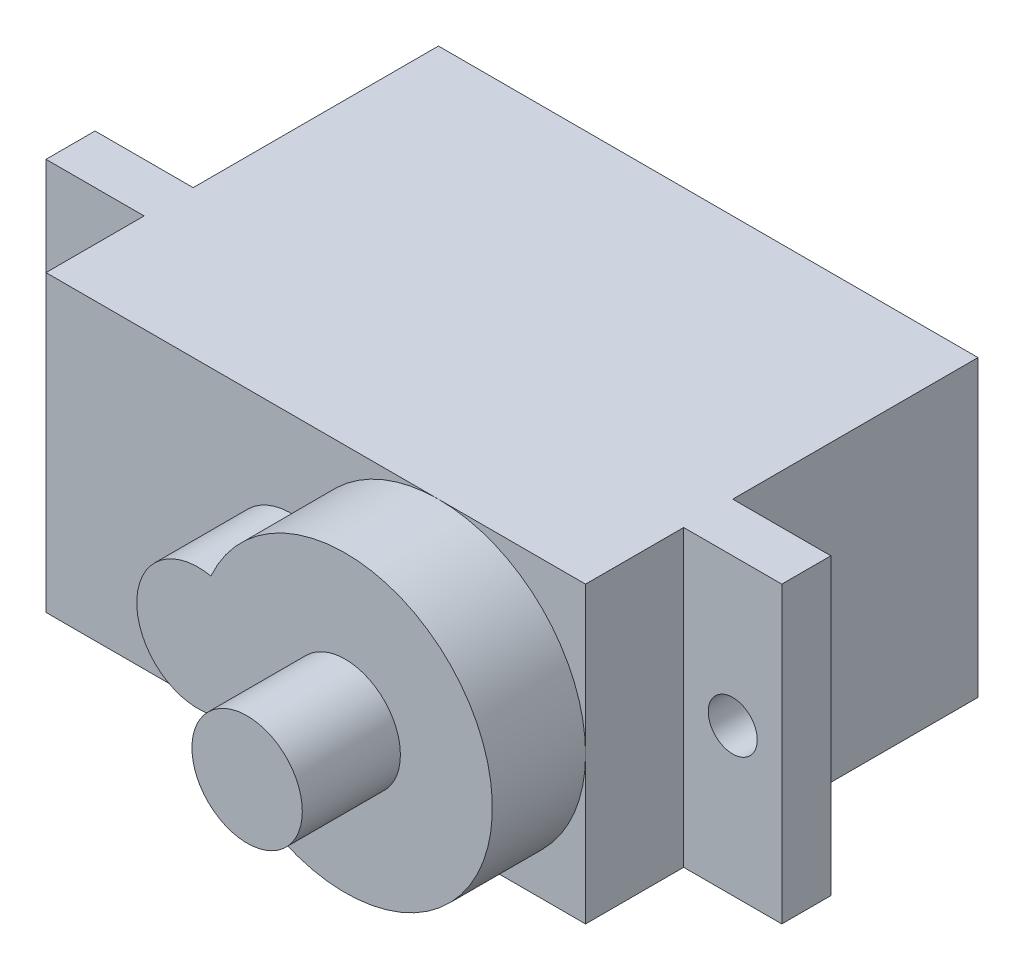
ISO-10303-21;
HEADER;
FILE_DESCRIPTION(('STEP AP214'),'2;1');
FILE_NAME('part.step','',(''),(''),'','','');
FILE_SCHEMA(('AUTOMOTIVE_DESIGN { 1 0 10303 214 1 1 1 1 }'));
ENDSEC;
DATA;
#1=APPLICATION_CONTEXT('core data for automotive mechanical design processes');
#2=APPLICATION_PROTOCOL_DEFINITION('international standard','automotive_design',2000,#1);
#3=PRODUCT_CONTEXT('',#1,'mechanical');
#4=PRODUCT('Part','Part','',(#3));
#5=PRODUCT_RELATED_PRODUCT_CATEGORY('part','',(#4));
#6=PRODUCT_DEFINITION_FORMATION('','',#4);
#7=PRODUCT_DEFINITION_CONTEXT('part definition',#1,'design');
#8=PRODUCT_DEFINITION('design','',#6,#7);
#9=PRODUCT_DEFINITION_SHAPE('','',#8);
#10=(LENGTH_UNIT() NAMED_UNIT(*) SI_UNIT(.MILLI.,.METRE.));
#11=(NAMED_UNIT(*) PLANE_ANGLE_UNIT() SI_UNIT($,.RADIAN.));
#12=(NAMED_UNIT(*) SI_UNIT($,.STERADIAN.) SOLID_ANGLE_UNIT());
#13=UNCERTAINTY_MEASURE_WITH_UNIT(LENGTH_MEASURE(1.E-05),#10,'distance_accuracy_value','');
#14=(GEOMETRIC_REPRESENTATION_CONTEXT(3) GLOBAL_UNCERTAINTY_ASSIGNED_CONTEXT((#13)) GLOBAL_UNIT_ASSIGNED_CONTEXT((#10,
#11,#12)) REPRESENTATION_CONTEXT('',''));
#15=CARTESIAN_POINT('',(0.,0.,0.));
#16=DIRECTION('',(0.,0.,1.));
#17=DIRECTION('',(1.,0.,0.));
#18=AXIS2_PLACEMENT_3D('',#15,#16,#17);
#19=CARTESIAN_POINT('',(0.,0.,16.));
#20=DIRECTION('',(0.,0.,1.));
#21=DIRECTION('',(1.,0.,0.));
#22=AXIS2_PLACEMENT_3D('',#19,#20,#21);
#23=PLANE('',#22);
#24=CARTESIAN_POINT('',(-0.999999999999999,0.,16.));
#25=DIRECTION('',(0.,0.,1.));
#26=DIRECTION('',(1.,0.,0.));
#27=AXIS2_PLACEMENT_3D('',#24,#25,#26);
#28=CIRCLE('',#27,2.5);
#29=CARTESIAN_POINT('',(-0.479166666666668,2.44514470714698,16.));
#30=VERTEX_POINT('',#29);
#31=CARTESIAN_POINT('',(-0.479166666666669,-2.44514470714698,16.));
#32=VERTEX_POINT('',#31);
#33=EDGE_CURVE('E161',#30,#32,#28,.T.);
#34=ORIENTED_EDGE('',*,*,#33,.F.);
#35=CARTESIAN_POINT('',(5.,0.,16.));
#36=DIRECTION('',(0.,0.,1.));
#37=DIRECTION('',(1.,0.,0.));
#38=AXIS2_PLACEMENT_3D('',#35,#36,#37);
#39=CIRCLE('',#38,6.);
#40=CARTESIAN_POINT('',(5.,6.,16.));
#41=VERTEX_POINT('',#40);
#42=EDGE_CURVE('E57',#41,#30,#39,.T.);
#43=ORIENTED_EDGE('',*,*,#42,.F.);
#44=DIRECTION('',(-1.,0.,0.));
#45=VECTOR('',#44,1.);
#46=CARTESIAN_POINT('',(-11.,6.,16.));
#47=LINE('',#46,#45);
#48=CARTESIAN_POINT('',(-11.,6.,16.));
#49=VERTEX_POINT('',#48);
#50=EDGE_CURVE('E185',#41,#49,#47,.T.);
#51=ORIENTED_EDGE('',*,*,#50,.T.);
#52=DIRECTION('',(0.,-1.,0.));
#53=VECTOR('',#52,1.);
#54=CARTESIAN_POINT('',(-11.,6.,16.));
#55=LINE('',#54,#53);
#56=CARTESIAN_POINT('',(-11.,-6.,16.));
#57=VERTEX_POINT('',#56);
#58=EDGE_CURVE('E174',#49,#57,#55,.T.);
#59=ORIENTED_EDGE('',*,*,#58,.T.);
#60=DIRECTION('',(1.,0.,0.));
#61=VECTOR('',#60,1.);
#62=CARTESIAN_POINT('',(-11.,-6.,16.));
#63=LINE('',#62,#61);
#64=CARTESIAN_POINT('',(5.,-6.,16.));
#65=VERTEX_POINT('',#64);
#66=EDGE_CURVE('E179',#57,#65,#63,.T.);
#67=ORIENTED_EDGE('',*,*,#66,.T.);
#68=EDGE_CURVE('E45',#32,#65,#39,.T.);
#69=ORIENTED_EDGE('',*,*,#68,.F.);
#70=EDGE_LOOP('',(#34,#43,#51,#59,#67,#69));
#71=FACE_BOUND('',#70,.T.);
#72=ADVANCED_FACE('F34',(#71),#23,.T.);
#73=CARTESIAN_POINT('',(11.,0.,16.));
#74=VERTEX_POINT('',#73);
#75=EDGE_CURVE('E11',#65,#74,#39,.T.);
#76=ORIENTED_EDGE('',*,*,#75,.F.);
#77=CARTESIAN_POINT('',(11.,-6.,16.));
#78=VERTEX_POINT('',#77);
#79=EDGE_CURVE('E177',#65,#78,#63,.T.);
#80=ORIENTED_EDGE('',*,*,#79,.T.);
#81=DIRECTION('',(0.,1.,0.));
#82=VECTOR('',#81,1.);
#83=CARTESIAN_POINT('',(11.,6.,16.));
#84=LINE('',#83,#82);
#85=EDGE_CURVE('E182',#78,#74,#84,.T.);
#86=ORIENTED_EDGE('',*,*,#85,.T.);
#87=EDGE_LOOP('',(#76,#80,#86));
#88=FACE_BOUND('',#87,.T.);
#89=ADVANCED_FACE('F368',(#88),#23,.T.);
#90=CARTESIAN_POINT('',(0.,0.,12.));
#91=DIRECTION('',(0.,0.,1.));
#92=DIRECTION('',(1.,0.,0.));
#93=AXIS2_PLACEMENT_3D('',#90,#91,#92);
#94=PLANE('',#93);
#95=CARTESIAN_POINT('',(-13.,0.,12.));
#96=DIRECTION('',(0.,0.,1.));
#97=DIRECTION('',(1.,0.,0.));
#98=AXIS2_PLACEMENT_3D('',#95,#96,#97);
#99=CIRCLE('',#98,1.);
#100=CARTESIAN_POINT('',(-12.,0.,12.));
#101=VERTEX_POINT('',#100);
#102=EDGE_CURVE('E171',#101,#101,#99,.T.);
#103=ORIENTED_EDGE('',*,*,#102,.F.);
#104=EDGE_LOOP('',(#103));
#105=FACE_BOUND('',#104,.T.);
#106=DIRECTION('',(0.,-1.,0.));
#107=VECTOR('',#106,1.);
#108=CARTESIAN_POINT('',(-11.,6.,12.));
#109=LINE('',#108,#107);
#110=CARTESIAN_POINT('',(-11.,6.,12.));
#111=VERTEX_POINT('',#110);
#112=CARTESIAN_POINT('',(-11.,-6.,12.));
#113=VERTEX_POINT('',#112);
#114=EDGE_CURVE('E195',#111,#113,#109,.T.);
#115=ORIENTED_EDGE('',*,*,#114,.F.);
#116=DIRECTION('',(-1.,0.,0.));
#117=VECTOR('',#116,1.);
#118=CARTESIAN_POINT('',(-15.,6.,12.));
#119=LINE('',#118,#117);
#120=CARTESIAN_POINT('',(-15.,6.,12.));
#121=VERTEX_POINT('',#120);
#122=EDGE_CURVE('E316',#111,#121,#119,.T.);
#123=ORIENTED_EDGE('',*,*,#122,.T.);
#124=DIRECTION('',(0.,-1.,0.));
#125=VECTOR('',#124,1.);
#126=CARTESIAN_POINT('',(-15.,6.,12.));
#127=LINE('',#126,#125);
#128=CARTESIAN_POINT('',(-15.,-6.,12.));
#129=VERTEX_POINT('',#128);
#130=EDGE_CURVE('E314',#121,#129,#127,.T.);
#131=ORIENTED_EDGE('',*,*,#130,.T.);
#132=DIRECTION('',(1.,0.,0.));
#133=VECTOR('',#132,1.);
#134=CARTESIAN_POINT('',(-15.,-6.,12.));
#135=LINE('',#134,#133);
#136=EDGE_CURVE('E307',#129,#113,#135,.T.);
#137=ORIENTED_EDGE('',*,*,#136,.T.);
#138=EDGE_LOOP('',(#115,#123,#131,#137));
#139=FACE_BOUND('',#138,.T.);
#140=ADVANCED_FACE('F374',(#105,#139),#94,.T.);
#141=CARTESIAN_POINT('',(-11.,6.,10.));
#142=DIRECTION('',(1.,0.,0.));
#143=DIRECTION('',(0.,1.,0.));
#144=AXIS2_PLACEMENT_3D('',#141,#142,#143);
#145=PLANE('',#144);
#146=DIRECTION('',(0.,-1.,0.));
#147=VECTOR('',#146,1.);
#148=CARTESIAN_POINT('',(-11.,6.,0.));
#149=LINE('',#148,#147);
#150=CARTESIAN_POINT('',(-11.,6.,0.));
#151=VERTEX_POINT('',#150);
#152=CARTESIAN_POINT('',(-11.,-6.,0.));
#153=VERTEX_POINT('',#152);
#154=EDGE_CURVE('E266',#151,#153,#149,.T.);
#155=ORIENTED_EDGE('',*,*,#154,.T.);
#156=DIRECTION('',(0.,0.,-1.));
#157=VECTOR('',#156,1.);
#158=CARTESIAN_POINT('',(-11.,-6.,10.));
#159=LINE('',#158,#157);
#160=CARTESIAN_POINT('',(-11.,-6.,10.));
#161=VERTEX_POINT('',#160);
#162=EDGE_CURVE('E294',#161,#153,#159,.T.);
#163=ORIENTED_EDGE('',*,*,#162,.F.);
#164=DIRECTION('',(0.,-1.,0.));
#165=VECTOR('',#164,1.);
#166=CARTESIAN_POINT('',(-11.,6.,10.));
#167=LINE('',#166,#165);
#168=CARTESIAN_POINT('',(-11.,6.,10.));
#169=VERTEX_POINT('',#168);
#170=EDGE_CURVE('E281',#169,#161,#167,.T.);
#171=ORIENTED_EDGE('',*,*,#170,.F.);
#172=DIRECTION('',(0.,0.,-1.));
#173=VECTOR('',#172,1.);
#174=CARTESIAN_POINT('',(-11.,6.,10.));
#175=LINE('',#174,#173);
#176=EDGE_CURVE('E286',#169,#151,#175,.T.);
#177=ORIENTED_EDGE('',*,*,#176,.T.);
#178=EDGE_LOOP('',(#155,#163,#171,#177));
#179=FACE_BOUND('',#178,.T.);
#180=ADVANCED_FACE('F36',(#179),#145,.F.);
#181=CARTESIAN_POINT('',(-11.,-6.,10.));
#182=DIRECTION('',(0.,1.,0.));
#183=DIRECTION('',(-1.,0.,0.));
#184=AXIS2_PLACEMENT_3D('',#181,#182,#183);
#185=PLANE('',#184);
#186=DIRECTION('',(1.,0.,0.));
#187=VECTOR('',#186,1.);
#188=CARTESIAN_POINT('',(-11.,-6.,0.));
#189=LINE('',#188,#187);
#190=CARTESIAN_POINT('',(11.,-6.,0.));
#191=VERTEX_POINT('',#190);
#192=EDGE_CURVE('E268',#153,#191,#189,.T.);
#193=ORIENTED_EDGE('',*,*,#192,.T.);
#194=DIRECTION('',(0.,0.,-1.));
#195=VECTOR('',#194,1.);
#196=CARTESIAN_POINT('',(11.,-6.,10.));
#197=LINE('',#196,#195);
#198=CARTESIAN_POINT('',(11.,-6.,10.));
#199=VERTEX_POINT('',#198);
#200=EDGE_CURVE('E285',#199,#191,#197,.T.);
#201=ORIENTED_EDGE('',*,*,#200,.F.);
#202=DIRECTION('',(1.,0.,0.));
#203=VECTOR('',#202,1.);
#204=CARTESIAN_POINT('',(-15.,-6.,10.));
#205=LINE('',#204,#203);
#206=CARTESIAN_POINT('',(15.,-6.,10.));
#207=VERTEX_POINT('',#206);
#208=EDGE_CURVE('E228',#199,#207,#205,.T.);
#209=ORIENTED_EDGE('',*,*,#208,.T.);
#210=DIRECTION('',(0.,0.,-1.));
#211=VECTOR('',#210,1.);
#212=CARTESIAN_POINT('',(15.,-6.,12.));
#213=LINE('',#212,#211);
#214=CARTESIAN_POINT('',(15.,-6.,12.));
#215=VERTEX_POINT('',#214);
#216=EDGE_CURVE('E262',#215,#207,#213,.T.);
#217=ORIENTED_EDGE('',*,*,#216,.F.);
#218=CARTESIAN_POINT('',(11.,-6.,12.));
#219=VERTEX_POINT('',#218);
#220=EDGE_CURVE('E311',#219,#215,#135,.T.);
#221=ORIENTED_EDGE('',*,*,#220,.F.);
#222=DIRECTION('',(0.,0.,-1.));
#223=VECTOR('',#222,1.);
#224=CARTESIAN_POINT('',(11.,-6.,16.));
#225=LINE('',#224,#223);
#226=EDGE_CURVE('E208',#78,#219,#225,.T.);
#227=ORIENTED_EDGE('',*,*,#226,.F.);
#228=ORIENTED_EDGE('',*,*,#79,.F.);
#229=ORIENTED_EDGE('',*,*,#66,.F.);
#230=DIRECTION('',(0.,0.,-1.));
#231=VECTOR('',#230,1.);
#232=CARTESIAN_POINT('',(-11.,-6.,16.));
#233=LINE('',#232,#231);
#234=EDGE_CURVE('E215',#57,#113,#233,.T.);
#235=ORIENTED_EDGE('',*,*,#234,.T.);
#236=ORIENTED_EDGE('',*,*,#136,.F.);
#237=DIRECTION('',(0.,0.,-1.));
#238=VECTOR('',#237,1.);
#239=CARTESIAN_POINT('',(-15.,-6.,12.));
#240=LINE('',#239,#238);
#241=CARTESIAN_POINT('',(-15.,-6.,10.));
#242=VERTEX_POINT('',#241);
#243=EDGE_CURVE('E264',#129,#242,#240,.T.);
#244=ORIENTED_EDGE('',*,*,#243,.T.);
#245=EDGE_CURVE('E234',#242,#161,#205,.T.);
#246=ORIENTED_EDGE('',*,*,#245,.T.);
#247=ORIENTED_EDGE('',*,*,#162,.T.);
#248=EDGE_LOOP('',(#193,#201,#209,#217,#221,#227,#228,#229,#235,#236,#244,#246,#247));
#249=FACE_BOUND('',#248,.T.);
#250=ADVANCED_FACE('F333',(#249),#185,.F.);
#251=CARTESIAN_POINT('',(11.,6.,10.));
#252=DIRECTION('',(-1.,0.,0.));
#253=DIRECTION('',(0.,-1.,0.));
#254=AXIS2_PLACEMENT_3D('',#251,#252,#253);
#255=PLANE('',#254);
#256=DIRECTION('',(0.,1.,0.));
#257=VECTOR('',#256,1.);
#258=CARTESIAN_POINT('',(11.,6.,0.));
#259=LINE('',#258,#257);
#260=CARTESIAN_POINT('',(11.,6.,0.));
#261=VERTEX_POINT('',#260);
#262=EDGE_CURVE('E273',#191,#261,#259,.T.);
#263=ORIENTED_EDGE('',*,*,#262,.T.);
#264=DIRECTION('',(0.,0.,-1.));
#265=VECTOR('',#264,1.);
#266=CARTESIAN_POINT('',(11.,6.,10.));
#267=LINE('',#266,#265);
#268=CARTESIAN_POINT('',(11.,6.,10.));
#269=VERTEX_POINT('',#268);
#270=EDGE_CURVE('E282',#269,#261,#267,.T.);
#271=ORIENTED_EDGE('',*,*,#270,.F.);
#272=DIRECTION('',(0.,1.,0.));
#273=VECTOR('',#272,1.);
#274=CARTESIAN_POINT('',(11.,6.,10.));
#275=LINE('',#274,#273);
#276=EDGE_CURVE('E289',#199,#269,#275,.T.);
#277=ORIENTED_EDGE('',*,*,#276,.F.);
#278=ORIENTED_EDGE('',*,*,#200,.T.);
#279=EDGE_LOOP('',(#263,#271,#277,#278));
#280=FACE_BOUND('',#279,.T.);
#281=ADVANCED_FACE('F346',(#280),#255,.F.);
#282=CARTESIAN_POINT('',(-11.,6.,10.));
#283=DIRECTION('',(0.,-1.,0.));
#284=DIRECTION('',(0.,0.,-1.));
#285=AXIS2_PLACEMENT_3D('',#282,#283,#284);
#286=PLANE('',#285);
#287=DIRECTION('',(-1.,0.,0.));
#288=VECTOR('',#287,1.);
#289=CARTESIAN_POINT('',(-11.,6.,0.));
#290=LINE('',#289,#288);
#291=EDGE_CURVE('E279',#261,#151,#290,.T.);
#292=ORIENTED_EDGE('',*,*,#291,.T.);
#293=ORIENTED_EDGE('',*,*,#176,.F.);
#294=DIRECTION('',(-1.,0.,0.));
#295=VECTOR('',#294,1.);
#296=CARTESIAN_POINT('',(-15.,6.,10.));
#297=LINE('',#296,#295);
#298=CARTESIAN_POINT('',(-15.,6.,10.));
#299=VERTEX_POINT('',#298);
#300=EDGE_CURVE('E249',#169,#299,#297,.T.);
#301=ORIENTED_EDGE('',*,*,#300,.T.);
#302=DIRECTION('',(0.,0.,-1.));
#303=VECTOR('',#302,1.);
#304=CARTESIAN_POINT('',(-15.,6.,12.));
#305=LINE('',#304,#303);
#306=EDGE_CURVE('E255',#121,#299,#305,.T.);
#307=ORIENTED_EDGE('',*,*,#306,.F.);
#308=ORIENTED_EDGE('',*,*,#122,.F.);
#309=DIRECTION('',(0.,0.,-1.));
#310=VECTOR('',#309,1.);
#311=CARTESIAN_POINT('',(-11.,6.,16.));
#312=LINE('',#311,#310);
#313=EDGE_CURVE('E189',#49,#111,#312,.T.);
#314=ORIENTED_EDGE('',*,*,#313,.F.);
#315=ORIENTED_EDGE('',*,*,#50,.F.);
#316=CARTESIAN_POINT('',(11.,6.,16.));
#317=VERTEX_POINT('',#316);
#318=EDGE_CURVE('E186',#317,#41,#47,.T.);
#319=ORIENTED_EDGE('',*,*,#318,.F.);
#320=DIRECTION('',(0.,0.,-1.));
#321=VECTOR('',#320,1.);
#322=CARTESIAN_POINT('',(11.,6.,16.));
#323=LINE('',#322,#321);
#324=CARTESIAN_POINT('',(11.,6.,12.));
#325=VERTEX_POINT('',#324);
#326=EDGE_CURVE('E202',#317,#325,#323,.T.);
#327=ORIENTED_EDGE('',*,*,#326,.T.);
#328=CARTESIAN_POINT('',(15.,6.,12.));
#329=VERTEX_POINT('',#328);
#330=EDGE_CURVE('E259',#329,#325,#119,.T.);
#331=ORIENTED_EDGE('',*,*,#330,.F.);
#332=DIRECTION('',(0.,0.,-1.));
#333=VECTOR('',#332,1.);
#334=CARTESIAN_POINT('',(15.,6.,12.));
#335=LINE('',#334,#333);
#336=CARTESIAN_POINT('',(15.,6.,10.));
#337=VERTEX_POINT('',#336);
#338=EDGE_CURVE('E258',#329,#337,#335,.T.);
#339=ORIENTED_EDGE('',*,*,#338,.T.);
#340=EDGE_CURVE('E251',#337,#269,#297,.T.);
#341=ORIENTED_EDGE('',*,*,#340,.T.);
#342=ORIENTED_EDGE('',*,*,#270,.T.);
#343=EDGE_LOOP('',(#292,#293,#301,#307,#308,#314,#315,#319,#327,#331,#339,#341,#342));
#344=FACE_BOUND('',#343,.T.);
#345=ADVANCED_FACE('F338',(#344),#286,.F.);
#346=CARTESIAN_POINT('',(0.,0.,0.));
#347=DIRECTION('',(0.,0.,1.));
#348=DIRECTION('',(1.,0.,0.));
#349=AXIS2_PLACEMENT_3D('',#346,#347,#348);
#350=PLANE('',#349);
#351=ORIENTED_EDGE('',*,*,#154,.F.);
#352=ORIENTED_EDGE('',*,*,#291,.F.);
#353=ORIENTED_EDGE('',*,*,#262,.F.);
#354=ORIENTED_EDGE('',*,*,#192,.F.);
#355=EDGE_LOOP('',(#351,#352,#353,#354));
#356=FACE_BOUND('',#355,.T.);
#357=ADVANCED_FACE('F349',(#356),#350,.F.);
#358=CARTESIAN_POINT('',(0.,0.,10.));
#359=DIRECTION('',(0.,0.,1.));
#360=DIRECTION('',(1.,0.,0.));
#361=AXIS2_PLACEMENT_3D('',#358,#359,#360);
#362=PLANE('',#361);
#363=CARTESIAN_POINT('',(-13.,0.,10.));
#364=DIRECTION('',(0.,0.,1.));
#365=DIRECTION('',(1.,0.,0.));
#366=AXIS2_PLACEMENT_3D('',#363,#364,#365);
#367=CIRCLE('',#366,1.);
#368=CARTESIAN_POINT('',(-12.,0.,10.));
#369=VERTEX_POINT('',#368);
#370=EDGE_CURVE('E38',#369,#369,#367,.T.);
#371=ORIENTED_EDGE('',*,*,#370,.T.);
#372=EDGE_LOOP('',(#371));
#373=FACE_BOUND('',#372,.T.);
#374=ORIENTED_EDGE('',*,*,#300,.F.);
#375=ORIENTED_EDGE('',*,*,#170,.T.);
#376=ORIENTED_EDGE('',*,*,#245,.F.);
#377=DIRECTION('',(0.,-1.,0.));
#378=VECTOR('',#377,1.);
#379=CARTESIAN_POINT('',(-15.,6.,10.));
#380=LINE('',#379,#378);
#381=EDGE_CURVE('E224',#299,#242,#380,.T.);
#382=ORIENTED_EDGE('',*,*,#381,.F.);
#383=EDGE_LOOP('',(#374,#375,#376,#382));
#384=FACE_BOUND('',#383,.T.);
#385=ADVANCED_FACE('F353',(#373,#384),#362,.F.);
#386=CARTESIAN_POINT('',(13.,0.,10.));
#387=DIRECTION('',(0.,0.,1.));
#388=DIRECTION('',(1.,0.,0.));
#389=AXIS2_PLACEMENT_3D('',#386,#387,#388);
#390=CIRCLE('',#389,1.);
#391=CARTESIAN_POINT('',(14.,0.,10.));
#392=VERTEX_POINT('',#391);
#393=EDGE_CURVE('E165',#392,#392,#390,.T.);
#394=ORIENTED_EDGE('',*,*,#393,.T.);
#395=EDGE_LOOP('',(#394));
#396=FACE_BOUND('',#395,.T.);
#397=ORIENTED_EDGE('',*,*,#208,.F.);
#398=ORIENTED_EDGE('',*,*,#276,.T.);
#399=ORIENTED_EDGE('',*,*,#340,.F.);
#400=DIRECTION('',(0.,1.,0.));
#401=VECTOR('',#400,1.);
#402=CARTESIAN_POINT('',(15.,6.,10.));
#403=LINE('',#402,#401);
#404=EDGE_CURVE('E242',#207,#337,#403,.T.);
#405=ORIENTED_EDGE('',*,*,#404,.F.);
#406=EDGE_LOOP('',(#397,#398,#399,#405));
#407=FACE_BOUND('',#406,.T.);
#408=ADVANCED_FACE('F343',(#396,#407),#362,.F.);
#409=CARTESIAN_POINT('',(-15.,6.,12.));
#410=DIRECTION('',(1.,0.,0.));
#411=DIRECTION('',(0.,1.,0.));
#412=AXIS2_PLACEMENT_3D('',#409,#410,#411);
#413=PLANE('',#412);
#414=ORIENTED_EDGE('',*,*,#381,.T.);
#415=ORIENTED_EDGE('',*,*,#243,.F.);
#416=ORIENTED_EDGE('',*,*,#130,.F.);
#417=ORIENTED_EDGE('',*,*,#306,.T.);
#418=EDGE_LOOP('',(#414,#415,#416,#417));
#419=FACE_BOUND('',#418,.T.);
#420=ADVANCED_FACE('F354',(#419),#413,.F.);
#421=CARTESIAN_POINT('',(15.,6.,12.));
#422=DIRECTION('',(-1.,0.,0.));
#423=DIRECTION('',(0.,0.,1.));
#424=AXIS2_PLACEMENT_3D('',#421,#422,#423);
#425=PLANE('',#424);
#426=ORIENTED_EDGE('',*,*,#404,.T.);
#427=ORIENTED_EDGE('',*,*,#338,.F.);
#428=DIRECTION('',(0.,1.,0.));
#429=VECTOR('',#428,1.);
#430=CARTESIAN_POINT('',(15.,6.,12.));
#431=LINE('',#430,#429);
#432=EDGE_CURVE('E310',#215,#329,#431,.T.);
#433=ORIENTED_EDGE('',*,*,#432,.F.);
#434=ORIENTED_EDGE('',*,*,#216,.T.);
#435=EDGE_LOOP('',(#426,#427,#433,#434));
#436=FACE_BOUND('',#435,.T.);
#437=ADVANCED_FACE('F356',(#436),#425,.F.);
#438=CARTESIAN_POINT('',(13.,0.,12.));
#439=DIRECTION('',(0.,0.,1.));
#440=DIRECTION('',(1.,0.,0.));
#441=AXIS2_PLACEMENT_3D('',#438,#439,#440);
#442=CIRCLE('',#441,1.);
#443=CARTESIAN_POINT('',(14.,0.,12.));
#444=VERTEX_POINT('',#443);
#445=EDGE_CURVE('E162',#444,#444,#442,.T.);
#446=ORIENTED_EDGE('',*,*,#445,.F.);
#447=EDGE_LOOP('',(#446));
#448=FACE_BOUND('',#447,.T.);
#449=DIRECTION('',(0.,1.,0.));
#450=VECTOR('',#449,1.);
#451=CARTESIAN_POINT('',(11.,6.,12.));
#452=LINE('',#451,#450);
#453=EDGE_CURVE('E178',#219,#325,#452,.T.);
#454=ORIENTED_EDGE('',*,*,#453,.F.);
#455=ORIENTED_EDGE('',*,*,#220,.T.);
#456=ORIENTED_EDGE('',*,*,#432,.T.);
#457=ORIENTED_EDGE('',*,*,#330,.T.);
#458=EDGE_LOOP('',(#454,#455,#456,#457));
#459=FACE_BOUND('',#458,.T.);
#460=ADVANCED_FACE('F325',(#448,#459),#94,.T.);
#461=CARTESIAN_POINT('',(-11.,6.,16.));
#462=DIRECTION('',(1.,0.,0.));
#463=DIRECTION('',(0.,1.,0.));
#464=AXIS2_PLACEMENT_3D('',#461,#462,#463);
#465=PLANE('',#464);
#466=ORIENTED_EDGE('',*,*,#114,.T.);
#467=ORIENTED_EDGE('',*,*,#234,.F.);
#468=ORIENTED_EDGE('',*,*,#58,.F.);
#469=ORIENTED_EDGE('',*,*,#313,.T.);
#470=EDGE_LOOP('',(#466,#467,#468,#469));
#471=FACE_BOUND('',#470,.T.);
#472=ADVANCED_FACE('F387',(#471),#465,.F.);
#473=CARTESIAN_POINT('',(11.,6.,16.));
#474=DIRECTION('',(-1.,0.,0.));
#475=DIRECTION('',(0.,0.,1.));
#476=AXIS2_PLACEMENT_3D('',#473,#474,#475);
#477=PLANE('',#476);
#478=ORIENTED_EDGE('',*,*,#453,.T.);
#479=ORIENTED_EDGE('',*,*,#326,.F.);
#480=EDGE_CURVE('E181',#74,#317,#84,.T.);
#481=ORIENTED_EDGE('',*,*,#480,.F.);
#482=ORIENTED_EDGE('',*,*,#85,.F.);
#483=ORIENTED_EDGE('',*,*,#226,.T.);
#484=EDGE_LOOP('',(#478,#479,#481,#482,#483));
#485=FACE_BOUND('',#484,.T.);
#486=ADVANCED_FACE('F328',(#485),#477,.F.);
#487=EDGE_CURVE('E43',#74,#41,#39,.T.);
#488=ORIENTED_EDGE('',*,*,#487,.F.);
#489=ORIENTED_EDGE('',*,*,#480,.T.);
#490=ORIENTED_EDGE('',*,*,#318,.T.);
#491=EDGE_LOOP('',(#488,#489,#490));
#492=FACE_BOUND('',#491,.T.);
#493=ADVANCED_FACE('F370',(#492),#23,.T.);
#494=CARTESIAN_POINT('',(-13.,0.,-2.50000000007189E-05));
#495=DIRECTION('',(0.,0.,1.));
#496=DIRECTION('',(1.,0.,0.));
#497=AXIS2_PLACEMENT_3D('',#494,#495,#496);
#498=CYLINDRICAL_SURFACE('',#497,1.);
#499=ORIENTED_EDGE('',*,*,#102,.T.);
#500=EDGE_LOOP('',(#499));
#501=FACE_BOUND('',#500,.T.);
#502=ORIENTED_EDGE('',*,*,#370,.F.);
#503=EDGE_LOOP('',(#502));
#504=FACE_BOUND('',#503,.T.);
#505=ADVANCED_FACE('F379',(#501,#504),#498,.F.);
#506=CARTESIAN_POINT('',(13.,0.,-2.50000000007189E-05));
#507=DIRECTION('',(0.,0.,1.));
#508=DIRECTION('',(1.,0.,0.));
#509=AXIS2_PLACEMENT_3D('',#506,#507,#508);
#510=CYLINDRICAL_SURFACE('',#509,1.);
#511=ORIENTED_EDGE('',*,*,#445,.T.);
#512=EDGE_LOOP('',(#511));
#513=FACE_BOUND('',#512,.T.);
#514=ORIENTED_EDGE('',*,*,#393,.F.);
#515=EDGE_LOOP('',(#514));
#516=FACE_BOUND('',#515,.T.);
#517=ADVANCED_FACE('F385',(#513,#516),#510,.F.);
#518=CARTESIAN_POINT('',(-0.999999999999999,0.,19.8));
#519=DIRECTION('',(0.,0.,-1.));
#520=DIRECTION('',(-1.,0.,0.));
#521=AXIS2_PLACEMENT_3D('',#518,#519,#520);
#522=CYLINDRICAL_SURFACE('',#521,2.5);
#523=ORIENTED_EDGE('',*,*,#33,.T.);
#524=DIRECTION('',(0.,0.,-1.));
#525=VECTOR('',#524,1.);
#526=CARTESIAN_POINT('',(-0.479166666666669,-2.44514470714698,19.8));
#527=LINE('',#526,#525);
#528=CARTESIAN_POINT('',(-0.479166666666669,-2.44514470714698,19.8));
#529=VERTEX_POINT('',#528);
#530=EDGE_CURVE('E149',#529,#32,#527,.T.);
#531=ORIENTED_EDGE('',*,*,#530,.F.);
#532=CARTESIAN_POINT('',(-0.999999999999999,0.,19.8));
#533=DIRECTION('',(0.,0.,1.));
#534=DIRECTION('',(1.,0.,0.));
#535=AXIS2_PLACEMENT_3D('',#532,#533,#534);
#536=CIRCLE('',#535,2.5);
#537=CARTESIAN_POINT('',(-0.479166666666668,2.44514470714698,19.8));
#538=VERTEX_POINT('',#537);
#539=EDGE_CURVE('E155',#538,#529,#536,.T.);
#540=ORIENTED_EDGE('',*,*,#539,.F.);
#541=DIRECTION('',(0.,0.,-1.));
#542=VECTOR('',#541,1.);
#543=CARTESIAN_POINT('',(-0.479166666666668,2.44514470714698,19.8));
#544=LINE('',#543,#542);
#545=EDGE_CURVE('E152',#538,#30,#544,.T.);
#546=ORIENTED_EDGE('',*,*,#545,.T.);
#547=EDGE_LOOP('',(#523,#531,#540,#546));
#548=FACE_BOUND('',#547,.T.);
#549=ADVANCED_FACE('F160',(#548),#522,.T.);
#550=CARTESIAN_POINT('',(5.,0.,19.8));
#551=DIRECTION('',(0.,0.,-1.));
#552=DIRECTION('',(-1.,0.,0.));
#553=AXIS2_PLACEMENT_3D('',#550,#551,#552);
#554=CYLINDRICAL_SURFACE('',#553,6.);
#555=ORIENTED_EDGE('',*,*,#68,.T.);
#556=ORIENTED_EDGE('',*,*,#75,.T.);
#557=ORIENTED_EDGE('',*,*,#487,.T.);
#558=ORIENTED_EDGE('',*,*,#42,.T.);
#559=ORIENTED_EDGE('',*,*,#545,.F.);
#560=CARTESIAN_POINT('',(5.,0.,19.8));
#561=DIRECTION('',(0.,0.,1.));
#562=DIRECTION('',(1.,0.,0.));
#563=AXIS2_PLACEMENT_3D('',#560,#561,#562);
#564=CIRCLE('',#563,6.);
#565=EDGE_CURVE('E145',#529,#538,#564,.T.);
#566=ORIENTED_EDGE('',*,*,#565,.F.);
#567=ORIENTED_EDGE('',*,*,#530,.T.);
#568=EDGE_LOOP('',(#555,#556,#557,#558,#559,#566,#567));
#569=FACE_BOUND('',#568,.T.);
#570=ADVANCED_FACE('F147',(#569),#554,.T.);
#571=CARTESIAN_POINT('',(2.,0.,19.8));
#572=DIRECTION('',(0.,0.,1.));
#573=DIRECTION('',(1.,0.,0.));
#574=AXIS2_PLACEMENT_3D('',#571,#572,#573);
#575=PLANE('',#574);
#576=CARTESIAN_POINT('',(5.,0.,19.8));
#577=DIRECTION('',(0.,0.,1.));
#578=DIRECTION('',(1.,0.,0.));
#579=AXIS2_PLACEMENT_3D('',#576,#577,#578);
#580=CIRCLE('',#579,2.25);
#581=CARTESIAN_POINT('',(7.25,0.,19.8));
#582=VERTEX_POINT('',#581);
#583=EDGE_CURVE('E392',#582,#582,#580,.T.);
#584=ORIENTED_EDGE('',*,*,#583,.F.);
#585=EDGE_LOOP('',(#584));
#586=FACE_BOUND('',#585,.T.);
#587=ORIENTED_EDGE('',*,*,#539,.T.);
#588=ORIENTED_EDGE('',*,*,#565,.T.);
#589=EDGE_LOOP('',(#587,#588));
#590=FACE_BOUND('',#589,.T.);
#591=ADVANCED_FACE('F157',(#586,#590),#575,.T.);
#592=CARTESIAN_POINT('',(5.,0.,23.8));
#593=DIRECTION('',(0.,0.,-1.));
#594=DIRECTION('',(-1.,0.,0.));
#595=AXIS2_PLACEMENT_3D('',#592,#593,#594);
#596=CYLINDRICAL_SURFACE('',#595,2.25);
#597=CARTESIAN_POINT('',(5.,0.,23.8));
#598=DIRECTION('',(0.,0.,1.));
#599=DIRECTION('',(1.,0.,0.));
#600=AXIS2_PLACEMENT_3D('',#597,#598,#599);
#601=CIRCLE('',#600,2.25);
#602=CARTESIAN_POINT('',(7.25,0.,23.8));
#603=VERTEX_POINT('',#602);
#604=EDGE_CURVE('E389',#603,#603,#601,.T.);
#605=ORIENTED_EDGE('',*,*,#604,.F.);
#606=EDGE_LOOP('',(#605));
#607=FACE_BOUND('',#606,.T.);
#608=ORIENTED_EDGE('',*,*,#583,.T.);
#609=EDGE_LOOP('',(#608));
#610=FACE_BOUND('',#609,.T.);
#611=ADVANCED_FACE('F400',(#607,#610),#596,.T.);
#612=CARTESIAN_POINT('',(5.,0.,23.8));
#613=DIRECTION('',(0.,0.,1.));
#614=DIRECTION('',(1.,0.,0.));
#615=AXIS2_PLACEMENT_3D('',#612,#613,#614);
#616=PLANE('',#615);
#617=ORIENTED_EDGE('',*,*,#604,.T.);
#618=EDGE_LOOP('',(#617));
#619=FACE_BOUND('',#618,.T.);
#620=ADVANCED_FACE('F398',(#619),#616,.T.);
#621=CLOSED_SHELL('',(#72,#89,#140,#180,#250,#281,#345,#357,#385,#408,#420,#437,#460,#472,#486,
#493,#505,#517,#549,#570,#591,#611,#620));
#622=MANIFOLD_SOLID_BREP('B2',#621);
#623=ADVANCED_BREP_SHAPE_REPRESENTATION('',(#18,#622),#14);
#624=SHAPE_DEFINITION_REPRESENTATION(#9,#623);
ENDSEC;
END-ISO-10303-21;
